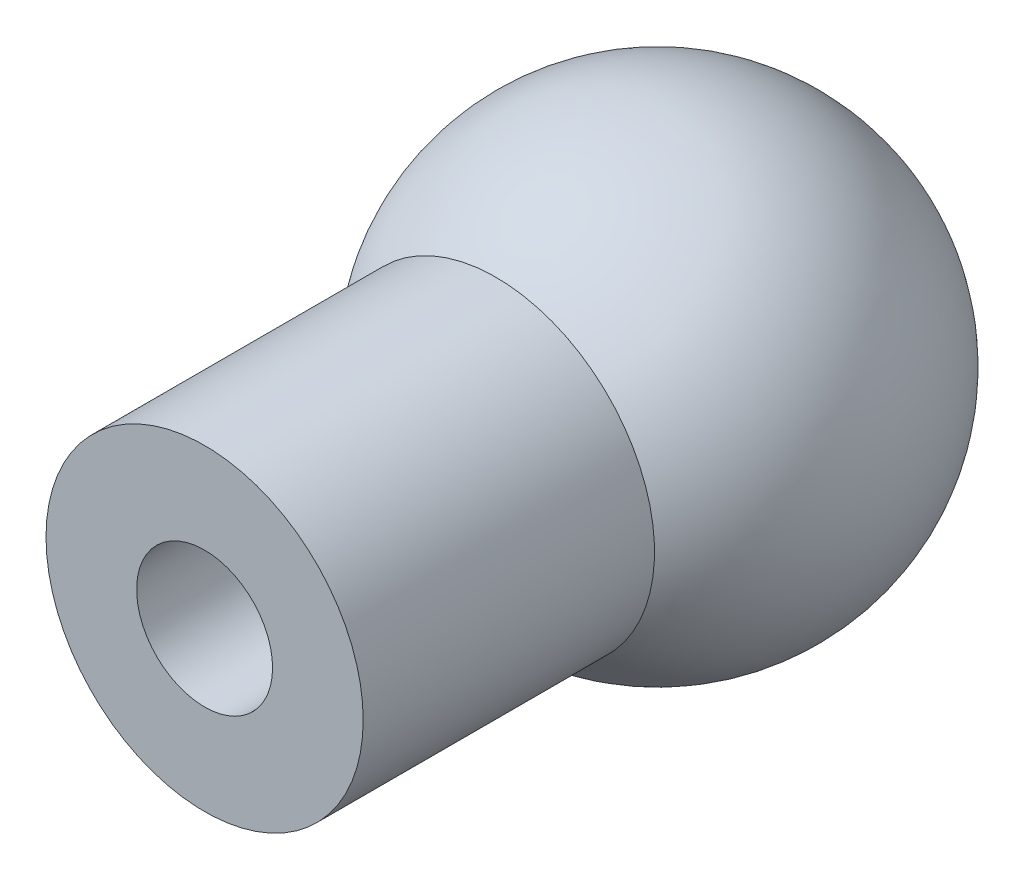
ISO-10303-21;
HEADER;
FILE_DESCRIPTION(('STEP AP214'),'2;1');
FILE_NAME('part.step','',(''),(''),'','','');
FILE_SCHEMA(('AUTOMOTIVE_DESIGN { 1 0 10303 214 1 1 1 1 }'));
ENDSEC;
DATA;
#1=APPLICATION_CONTEXT('core data for automotive mechanical design processes');
#2=APPLICATION_PROTOCOL_DEFINITION('international standard','automotive_design',2000,#1);
#3=PRODUCT_CONTEXT('',#1,'mechanical');
#4=PRODUCT('Part','Part','',(#3));
#5=PRODUCT_RELATED_PRODUCT_CATEGORY('part','',(#4));
#6=PRODUCT_DEFINITION_FORMATION('','',#4);
#7=PRODUCT_DEFINITION_CONTEXT('part definition',#1,'design');
#8=PRODUCT_DEFINITION('design','',#6,#7);
#9=PRODUCT_DEFINITION_SHAPE('','',#8);
#10=(LENGTH_UNIT() NAMED_UNIT(*) SI_UNIT(.MILLI.,.METRE.));
#11=(NAMED_UNIT(*) PLANE_ANGLE_UNIT() SI_UNIT($,.RADIAN.));
#12=(NAMED_UNIT(*) SI_UNIT($,.STERADIAN.) SOLID_ANGLE_UNIT());
#13=UNCERTAINTY_MEASURE_WITH_UNIT(LENGTH_MEASURE(1.E-05),#10,'distance_accuracy_value','');
#14=(GEOMETRIC_REPRESENTATION_CONTEXT(3) GLOBAL_UNCERTAINTY_ASSIGNED_CONTEXT((#13)) GLOBAL_UNIT_ASSIGNED_CONTEXT((#10,
#11,#12)) REPRESENTATION_CONTEXT('',''));
#15=CARTESIAN_POINT('',(0.,0.,0.));
#16=DIRECTION('',(0.,0.,1.));
#17=DIRECTION('',(1.,0.,0.));
#18=AXIS2_PLACEMENT_3D('',#15,#16,#17);
#19=CARTESIAN_POINT('',(0.,0.,5.));
#20=DIRECTION('',(0.,0.,-1.));
#21=DIRECTION('',(-1.,0.,0.));
#22=AXIS2_PLACEMENT_3D('',#19,#20,#21);
#23=CYLINDRICAL_SURFACE('',#22,1.5);
#24=CARTESIAN_POINT('',(0.,0.,0.));
#25=DIRECTION('',(0.,0.,1.));
#26=DIRECTION('',(1.,0.,0.));
#27=AXIS2_PLACEMENT_3D('',#24,#25,#26);
#28=CIRCLE('',#27,1.5);
#29=CARTESIAN_POINT('',(1.5,0.,0.));
#30=VERTEX_POINT('',#29);
#31=EDGE_CURVE('E40',#30,#30,#28,.T.);
#32=ORIENTED_EDGE('',*,*,#31,.F.);
#33=EDGE_LOOP('',(#32));
#34=FACE_BOUND('',#33,.T.);
#35=CARTESIAN_POINT('',(0.,0.,10.));
#36=DIRECTION('',(0.,0.,1.));
#37=DIRECTION('',(1.,0.,0.));
#38=AXIS2_PLACEMENT_3D('',#35,#36,#37);
#39=CIRCLE('',#38,1.5);
#40=CARTESIAN_POINT('',(1.5,0.,10.));
#41=VERTEX_POINT('',#40);
#42=EDGE_CURVE('E48',#41,#41,#39,.T.);
#43=ORIENTED_EDGE('',*,*,#42,.T.);
#44=EDGE_LOOP('',(#43));
#45=FACE_BOUND('',#44,.T.);
#46=ADVANCED_FACE('F33',(#34,#45),#23,.F.);
#47=CARTESIAN_POINT('',(0.,0.,0.));
#48=DIRECTION('',(0.,0.,1.));
#49=DIRECTION('',(1.,0.,0.));
#50=AXIS2_PLACEMENT_3D('',#47,#48,#49);
#51=PLANE('',#50);
#52=ORIENTED_EDGE('',*,*,#31,.T.);
#53=EDGE_LOOP('',(#52));
#54=FACE_BOUND('',#53,.T.);
#55=ADVANCED_FACE('F63',(#54),#51,.T.);
#56=CARTESIAN_POINT('',(0.,0.,10.));
#57=DIRECTION('',(0.,0.,-1.));
#58=DIRECTION('',(-1.,0.,0.));
#59=AXIS2_PLACEMENT_3D('',#56,#57,#58);
#60=CYLINDRICAL_SURFACE('',#59,3.5);
#61=CARTESIAN_POINT('',(0.,0.,10.));
#62=DIRECTION('',(0.,0.,1.));
#63=DIRECTION('',(1.,0.,0.));
#64=AXIS2_PLACEMENT_3D('',#61,#62,#63);
#65=CIRCLE('',#64,3.5);
#66=CARTESIAN_POINT('',(3.5,0.,10.));
#67=VERTEX_POINT('',#66);
#68=EDGE_CURVE('E44',#67,#67,#65,.T.);
#69=ORIENTED_EDGE('',*,*,#68,.F.);
#70=EDGE_LOOP('',(#69));
#71=FACE_BOUND('',#70,.T.);
#72=CARTESIAN_POINT('',(0.,0.,3.57071421427142));
#73=DIRECTION('',(0.,0.,-1.));
#74=DIRECTION('',(-1.,0.,0.));
#75=AXIS2_PLACEMENT_3D('',#72,#73,#74);
#76=CIRCLE('',#75,3.5);
#77=CARTESIAN_POINT('',(-3.5,0.,3.57071421427142));
#78=VERTEX_POINT('',#77);
#79=EDGE_CURVE('E10',#78,#78,#76,.F.);
#80=ORIENTED_EDGE('',*,*,#79,.T.);
#81=EDGE_LOOP('',(#80));
#82=FACE_BOUND('',#81,.T.);
#83=ADVANCED_FACE('F58',(#71,#82),#60,.T.);
#84=CARTESIAN_POINT('',(0.,0.,10.));
#85=DIRECTION('',(0.,0.,1.));
#86=DIRECTION('',(1.,0.,0.));
#87=AXIS2_PLACEMENT_3D('',#84,#85,#86);
#88=PLANE('',#87);
#89=ORIENTED_EDGE('',*,*,#42,.F.);
#90=EDGE_LOOP('',(#89));
#91=FACE_BOUND('',#90,.T.);
#92=ORIENTED_EDGE('',*,*,#68,.T.);
#93=EDGE_LOOP('',(#92));
#94=FACE_BOUND('',#93,.T.);
#95=ADVANCED_FACE('F55',(#91,#94),#88,.T.);
#96=CARTESIAN_POINT('',(0.,0.,0.));
#97=DIRECTION('',(0.,1.,0.));
#98=DIRECTION('',(1.,0.,0.));
#99=AXIS2_PLACEMENT_3D('',#96,#97,#98);
#100=SPHERICAL_SURFACE('',#99,5.);
#101=CARTESIAN_POINT('',(0.,0.,0.));
#102=DIRECTION('',(0.,0.,-1.));
#103=DIRECTION('',(-1.,0.,0.));
#104=AXIS2_PLACEMENT_3D('',#101,#102,#103);
#105=SPHERICAL_SURFACE('',#104,5.);
#106=ORIENTED_EDGE('',*,*,#79,.F.);
#107=EDGE_LOOP('',(#106));
#108=FACE_BOUND('',#107,.T.);
#109=ADVANCED_FACE('F35',(#108),#105,.T.);
#110=CLOSED_SHELL('',(#46,#55,#83,#95,#109));
#111=MANIFOLD_SOLID_BREP('B2',#110);
#112=ADVANCED_BREP_SHAPE_REPRESENTATION('',(#18,#111),#14);
#113=SHAPE_DEFINITION_REPRESENTATION(#9,#112);
ENDSEC;
END-ISO-10303-21;
